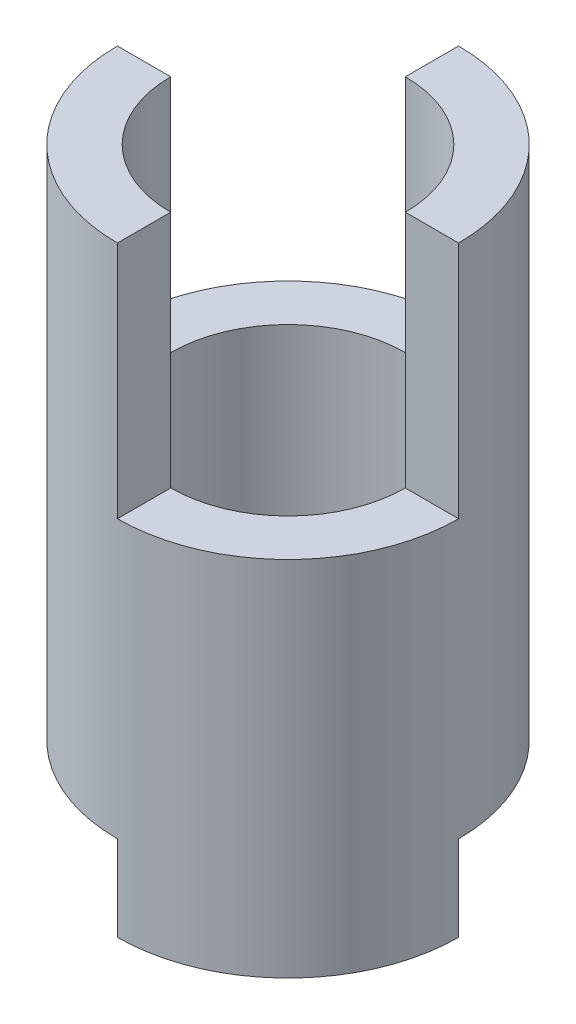
ISO-10303-21;
HEADER;
FILE_DESCRIPTION(('STEP AP214'),'2;1');
FILE_NAME('part.step','',(''),(''),'','','');
FILE_SCHEMA(('AUTOMOTIVE_DESIGN { 1 0 10303 214 1 1 1 1 }'));
ENDSEC;
DATA;
#1=APPLICATION_CONTEXT('core data for automotive mechanical design processes');
#2=APPLICATION_PROTOCOL_DEFINITION('international standard','automotive_design',2000,#1);
#3=PRODUCT_CONTEXT('',#1,'mechanical');
#4=PRODUCT('Part','Part','',(#3));
#5=PRODUCT_RELATED_PRODUCT_CATEGORY('part','',(#4));
#6=PRODUCT_DEFINITION_FORMATION('','',#4);
#7=PRODUCT_DEFINITION_CONTEXT('part definition',#1,'design');
#8=PRODUCT_DEFINITION('design','',#6,#7);
#9=PRODUCT_DEFINITION_SHAPE('','',#8);
#10=(LENGTH_UNIT() NAMED_UNIT(*) SI_UNIT(.MILLI.,.METRE.));
#11=(NAMED_UNIT(*) PLANE_ANGLE_UNIT() SI_UNIT($,.RADIAN.));
#12=(NAMED_UNIT(*) SI_UNIT($,.STERADIAN.) SOLID_ANGLE_UNIT());
#13=UNCERTAINTY_MEASURE_WITH_UNIT(LENGTH_MEASURE(1.E-05),#10,'distance_accuracy_value','');
#14=(GEOMETRIC_REPRESENTATION_CONTEXT(3) GLOBAL_UNCERTAINTY_ASSIGNED_CONTEXT((#13)) GLOBAL_UNIT_ASSIGNED_CONTEXT((#10,
#11,#12)) REPRESENTATION_CONTEXT('',''));
#15=CARTESIAN_POINT('',(0.,0.,0.));
#16=DIRECTION('',(0.,0.,1.));
#17=DIRECTION('',(1.,0.,0.));
#18=AXIS2_PLACEMENT_3D('',#15,#16,#17);
#19=CARTESIAN_POINT('',(0.,0.,0.));
#20=DIRECTION('',(0.,1.,0.));
#21=DIRECTION('',(0.,0.,1.));
#22=AXIS2_PLACEMENT_3D('',#19,#20,#21);
#23=PLANE('',#22);
#24=CARTESIAN_POINT('',(0.,0.,0.));
#25=DIRECTION('',(0.,1.,0.));
#26=DIRECTION('',(0.,0.,1.));
#27=AXIS2_PLACEMENT_3D('',#24,#25,#26);
#28=CIRCLE('',#27,2.75);
#29=CARTESIAN_POINT('',(0.,0.,2.75));
#30=VERTEX_POINT('',#29);
#31=CARTESIAN_POINT('',(2.75,0.,0.));
#32=VERTEX_POINT('',#31);
#33=EDGE_CURVE('E260',#30,#32,#28,.T.);
#34=ORIENTED_EDGE('',*,*,#33,.T.);
#35=DIRECTION('',(-1.,0.,0.));
#36=VECTOR('',#35,1.);
#37=CARTESIAN_POINT('',(2.75,0.,0.));
#38=LINE('',#37,#36);
#39=CARTESIAN_POINT('',(4.,0.,0.));
#40=VERTEX_POINT('',#39);
#41=EDGE_CURVE('E172',#40,#32,#38,.T.);
#42=ORIENTED_EDGE('',*,*,#41,.F.);
#43=CARTESIAN_POINT('',(0.,0.,0.));
#44=DIRECTION('',(0.,1.,0.));
#45=DIRECTION('',(0.,0.,1.));
#46=AXIS2_PLACEMENT_3D('',#43,#44,#45);
#47=CIRCLE('',#46,4.);
#48=CARTESIAN_POINT('',(0.,0.,4.));
#49=VERTEX_POINT('',#48);
#50=EDGE_CURVE('E46',#49,#40,#47,.T.);
#51=ORIENTED_EDGE('',*,*,#50,.F.);
#52=DIRECTION('',(0.,0.,1.));
#53=VECTOR('',#52,1.);
#54=CARTESIAN_POINT('',(0.,0.,2.75));
#55=LINE('',#54,#53);
#56=EDGE_CURVE('E196',#30,#49,#55,.T.);
#57=ORIENTED_EDGE('',*,*,#56,.F.);
#58=EDGE_LOOP('',(#34,#42,#51,#57));
#59=FACE_BOUND('',#58,.T.);
#60=ADVANCED_FACE('F42',(#59),#23,.F.);
#61=CARTESIAN_POINT('',(0.,14.1,0.));
#62=DIRECTION('',(0.,1.,0.));
#63=DIRECTION('',(0.,0.,1.));
#64=AXIS2_PLACEMENT_3D('',#61,#62,#63);
#65=PLANE('',#64);
#66=DIRECTION('',(-1.,0.,0.));
#67=VECTOR('',#66,1.);
#68=CARTESIAN_POINT('',(2.75,14.1,0.));
#69=LINE('',#68,#67);
#70=CARTESIAN_POINT('',(4.,14.1,0.));
#71=VERTEX_POINT('',#70);
#72=CARTESIAN_POINT('',(2.75,14.1,0.));
#73=VERTEX_POINT('',#72);
#74=EDGE_CURVE('E213',#71,#73,#69,.T.);
#75=ORIENTED_EDGE('',*,*,#74,.F.);
#76=CARTESIAN_POINT('',(0.,14.1,0.));
#77=DIRECTION('',(0.,1.,0.));
#78=DIRECTION('',(0.,0.,1.));
#79=AXIS2_PLACEMENT_3D('',#76,#77,#78);
#80=CIRCLE('',#79,4.);
#81=CARTESIAN_POINT('',(0.,14.1,-4.));
#82=VERTEX_POINT('',#81);
#83=EDGE_CURVE('E12',#71,#82,#80,.T.);
#84=ORIENTED_EDGE('',*,*,#83,.T.);
#85=DIRECTION('',(0.,0.,-1.));
#86=VECTOR('',#85,1.);
#87=CARTESIAN_POINT('',(0.,14.1,-2.75));
#88=LINE('',#87,#86);
#89=CARTESIAN_POINT('',(0.,14.1,-2.75));
#90=VERTEX_POINT('',#89);
#91=EDGE_CURVE('E226',#90,#82,#88,.T.);
#92=ORIENTED_EDGE('',*,*,#91,.F.);
#93=CARTESIAN_POINT('',(0.,14.1,0.));
#94=DIRECTION('',(0.,1.,0.));
#95=DIRECTION('',(0.,0.,1.));
#96=AXIS2_PLACEMENT_3D('',#93,#94,#95);
#97=CIRCLE('',#96,2.75);
#98=EDGE_CURVE('E259',#73,#90,#97,.T.);
#99=ORIENTED_EDGE('',*,*,#98,.F.);
#100=EDGE_LOOP('',(#75,#84,#92,#99));
#101=FACE_BOUND('',#100,.T.);
#102=ADVANCED_FACE('F284',(#101),#65,.T.);
#103=DIRECTION('',(0.,0.,1.));
#104=VECTOR('',#103,1.);
#105=CARTESIAN_POINT('',(0.,14.1,2.75));
#106=LINE('',#105,#104);
#107=CARTESIAN_POINT('',(0.,14.1,2.75));
#108=VERTEX_POINT('',#107);
#109=CARTESIAN_POINT('',(0.,14.1,4.));
#110=VERTEX_POINT('',#109);
#111=EDGE_CURVE('E202',#108,#110,#106,.T.);
#112=ORIENTED_EDGE('',*,*,#111,.F.);
#113=CARTESIAN_POINT('',(-2.75,14.1,0.));
#114=VERTEX_POINT('',#113);
#115=EDGE_CURVE('E256',#114,#108,#97,.T.);
#116=ORIENTED_EDGE('',*,*,#115,.F.);
#117=DIRECTION('',(1.,0.,0.));
#118=VECTOR('',#117,1.);
#119=CARTESIAN_POINT('',(-2.75,14.1,0.));
#120=LINE('',#119,#118);
#121=CARTESIAN_POINT('',(-4.,14.1,0.));
#122=VERTEX_POINT('',#121);
#123=EDGE_CURVE('E237',#122,#114,#120,.T.);
#124=ORIENTED_EDGE('',*,*,#123,.F.);
#125=EDGE_CURVE('E51',#122,#110,#80,.T.);
#126=ORIENTED_EDGE('',*,*,#125,.T.);
#127=EDGE_LOOP('',(#112,#116,#124,#126));
#128=FACE_BOUND('',#127,.T.);
#129=ADVANCED_FACE('F300',(#128),#65,.T.);
#130=CARTESIAN_POINT('',(0.,0.,-4.));
#131=VERTEX_POINT('',#130);
#132=CARTESIAN_POINT('',(-4.,0.,0.));
#133=VERTEX_POINT('',#132);
#134=EDGE_CURVE('E268',#131,#133,#47,.T.);
#135=ORIENTED_EDGE('',*,*,#134,.F.);
#136=DIRECTION('',(0.,0.,-1.));
#137=VECTOR('',#136,1.);
#138=CARTESIAN_POINT('',(0.,0.,-2.75));
#139=LINE('',#138,#137);
#140=CARTESIAN_POINT('',(0.,0.,-2.75));
#141=VERTEX_POINT('',#140);
#142=EDGE_CURVE('E332',#141,#131,#139,.T.);
#143=ORIENTED_EDGE('',*,*,#142,.F.);
#144=CARTESIAN_POINT('',(-2.75,0.,0.));
#145=VERTEX_POINT('',#144);
#146=EDGE_CURVE('E179',#141,#145,#28,.T.);
#147=ORIENTED_EDGE('',*,*,#146,.T.);
#148=DIRECTION('',(1.,0.,0.));
#149=VECTOR('',#148,1.);
#150=CARTESIAN_POINT('',(-2.75,0.,0.));
#151=LINE('',#150,#149);
#152=EDGE_CURVE('E189',#133,#145,#151,.T.);
#153=ORIENTED_EDGE('',*,*,#152,.F.);
#154=EDGE_LOOP('',(#135,#143,#147,#153));
#155=FACE_BOUND('',#154,.T.);
#156=ADVANCED_FACE('F320',(#155),#23,.F.);
#157=CARTESIAN_POINT('',(0.,14.1,0.));
#158=DIRECTION('',(0.,-1.,0.));
#159=DIRECTION('',(0.,0.,-1.));
#160=AXIS2_PLACEMENT_3D('',#157,#158,#159);
#161=CYLINDRICAL_SURFACE('',#160,4.);
#162=ORIENTED_EDGE('',*,*,#50,.T.);
#163=DIRECTION('',(0.,-1.,0.));
#164=VECTOR('',#163,1.);
#165=CARTESIAN_POINT('',(4.,2.,0.));
#166=LINE('',#165,#164);
#167=CARTESIAN_POINT('',(4.,2.,0.));
#168=VERTEX_POINT('',#167);
#169=EDGE_CURVE('E181',#168,#40,#166,.T.);
#170=ORIENTED_EDGE('',*,*,#169,.F.);
#171=CARTESIAN_POINT('',(0.,2.,0.));
#172=DIRECTION('',(0.,-1.,0.));
#173=DIRECTION('',(0.,0.,-1.));
#174=AXIS2_PLACEMENT_3D('',#171,#172,#173);
#175=CIRCLE('',#174,4.);
#176=CARTESIAN_POINT('',(0.,2.,-4.));
#177=VERTEX_POINT('',#176);
#178=EDGE_CURVE('E165',#177,#168,#175,.T.);
#179=ORIENTED_EDGE('',*,*,#178,.F.);
#180=DIRECTION('',(0.,-1.,0.));
#181=VECTOR('',#180,1.);
#182=CARTESIAN_POINT('',(0.,2.,-4.));
#183=LINE('',#182,#181);
#184=EDGE_CURVE('E163',#177,#131,#183,.T.);
#185=ORIENTED_EDGE('',*,*,#184,.T.);
#186=ORIENTED_EDGE('',*,*,#134,.T.);
#187=DIRECTION('',(0.,-1.,0.));
#188=VECTOR('',#187,1.);
#189=CARTESIAN_POINT('',(-4.,2.,0.));
#190=LINE('',#189,#188);
#191=CARTESIAN_POINT('',(-4.,2.,0.));
#192=VERTEX_POINT('',#191);
#193=EDGE_CURVE('E203',#192,#133,#190,.T.);
#194=ORIENTED_EDGE('',*,*,#193,.F.);
#195=CARTESIAN_POINT('',(0.,2.,0.));
#196=DIRECTION('',(0.,-1.,0.));
#197=DIRECTION('',(0.,0.,-1.));
#198=AXIS2_PLACEMENT_3D('',#195,#196,#197);
#199=CIRCLE('',#198,4.);
#200=CARTESIAN_POINT('',(0.,2.,4.));
#201=VERTEX_POINT('',#200);
#202=EDGE_CURVE('E192',#201,#192,#199,.T.);
#203=ORIENTED_EDGE('',*,*,#202,.F.);
#204=DIRECTION('',(0.,-1.,0.));
#205=VECTOR('',#204,1.);
#206=CARTESIAN_POINT('',(0.,2.,4.));
#207=LINE('',#206,#205);
#208=EDGE_CURVE('E205',#201,#49,#207,.T.);
#209=ORIENTED_EDGE('',*,*,#208,.T.);
#210=EDGE_LOOP('',(#162,#170,#179,#185,#186,#194,#203,#209));
#211=FACE_BOUND('',#210,.T.);
#212=ORIENTED_EDGE('',*,*,#83,.F.);
#213=DIRECTION('',(0.,1.,0.));
#214=VECTOR('',#213,1.);
#215=CARTESIAN_POINT('',(4.,8.5,0.));
#216=LINE('',#215,#214);
#217=CARTESIAN_POINT('',(4.,8.5,0.));
#218=VERTEX_POINT('',#217);
#219=EDGE_CURVE('E227',#218,#71,#216,.T.);
#220=ORIENTED_EDGE('',*,*,#219,.F.);
#221=CARTESIAN_POINT('',(0.,8.5,0.));
#222=DIRECTION('',(0.,1.,0.));
#223=DIRECTION('',(0.,0.,1.));
#224=AXIS2_PLACEMENT_3D('',#221,#222,#223);
#225=CIRCLE('',#224,4.);
#226=CARTESIAN_POINT('',(0.,8.5,4.));
#227=VERTEX_POINT('',#226);
#228=EDGE_CURVE('E216',#227,#218,#225,.T.);
#229=ORIENTED_EDGE('',*,*,#228,.F.);
#230=DIRECTION('',(0.,1.,0.));
#231=VECTOR('',#230,1.);
#232=CARTESIAN_POINT('',(0.,8.5,4.));
#233=LINE('',#232,#231);
#234=EDGE_CURVE('E229',#227,#110,#233,.T.);
#235=ORIENTED_EDGE('',*,*,#234,.T.);
#236=ORIENTED_EDGE('',*,*,#125,.F.);
#237=DIRECTION('',(0.,1.,0.));
#238=VECTOR('',#237,1.);
#239=CARTESIAN_POINT('',(-4.,8.5,0.));
#240=LINE('',#239,#238);
#241=CARTESIAN_POINT('',(-4.,8.5,0.));
#242=VERTEX_POINT('',#241);
#243=EDGE_CURVE('E250',#242,#122,#240,.T.);
#244=ORIENTED_EDGE('',*,*,#243,.F.);
#245=CARTESIAN_POINT('',(0.,8.5,0.));
#246=DIRECTION('',(0.,1.,0.));
#247=DIRECTION('',(0.,0.,1.));
#248=AXIS2_PLACEMENT_3D('',#245,#246,#247);
#249=CIRCLE('',#248,4.);
#250=CARTESIAN_POINT('',(0.,8.5,-4.));
#251=VERTEX_POINT('',#250);
#252=EDGE_CURVE('E240',#251,#242,#249,.T.);
#253=ORIENTED_EDGE('',*,*,#252,.F.);
#254=DIRECTION('',(0.,1.,0.));
#255=VECTOR('',#254,1.);
#256=CARTESIAN_POINT('',(0.,8.5,-4.));
#257=LINE('',#256,#255);
#258=EDGE_CURVE('E252',#251,#82,#257,.T.);
#259=ORIENTED_EDGE('',*,*,#258,.T.);
#260=EDGE_LOOP('',(#212,#220,#229,#235,#236,#244,#253,#259));
#261=FACE_BOUND('',#260,.T.);
#262=ADVANCED_FACE('F44',(#211,#261),#161,.T.);
#263=CARTESIAN_POINT('',(0.,14.1,0.));
#264=DIRECTION('',(0.,-1.,0.));
#265=DIRECTION('',(0.,0.,-1.));
#266=AXIS2_PLACEMENT_3D('',#263,#264,#265);
#267=CYLINDRICAL_SURFACE('',#266,2.75);
#268=DIRECTION('',(0.,-1.,0.));
#269=VECTOR('',#268,1.);
#270=CARTESIAN_POINT('',(2.75,2.,0.));
#271=LINE('',#270,#269);
#272=CARTESIAN_POINT('',(2.75,2.,0.));
#273=VERTEX_POINT('',#272);
#274=EDGE_CURVE('E198',#273,#32,#271,.T.);
#275=ORIENTED_EDGE('',*,*,#274,.T.);
#276=ORIENTED_EDGE('',*,*,#33,.F.);
#277=DIRECTION('',(0.,-1.,0.));
#278=VECTOR('',#277,1.);
#279=CARTESIAN_POINT('',(0.,2.,2.75));
#280=LINE('',#279,#278);
#281=CARTESIAN_POINT('',(0.,2.,2.75));
#282=VERTEX_POINT('',#281);
#283=EDGE_CURVE('E195',#282,#30,#280,.T.);
#284=ORIENTED_EDGE('',*,*,#283,.F.);
#285=CARTESIAN_POINT('',(0.,2.,0.));
#286=DIRECTION('',(0.,1.,0.));
#287=DIRECTION('',(0.,0.,-1.));
#288=AXIS2_PLACEMENT_3D('',#285,#286,#287);
#289=CIRCLE('',#288,2.75);
#290=CARTESIAN_POINT('',(-2.75,2.,0.));
#291=VERTEX_POINT('',#290);
#292=EDGE_CURVE('E186',#291,#282,#289,.T.);
#293=ORIENTED_EDGE('',*,*,#292,.F.);
#294=DIRECTION('',(0.,-1.,0.));
#295=VECTOR('',#294,1.);
#296=CARTESIAN_POINT('',(-2.75,2.,0.));
#297=LINE('',#296,#295);
#298=EDGE_CURVE('E200',#291,#145,#297,.T.);
#299=ORIENTED_EDGE('',*,*,#298,.T.);
#300=ORIENTED_EDGE('',*,*,#146,.F.);
#301=DIRECTION('',(0.,-1.,0.));
#302=VECTOR('',#301,1.);
#303=CARTESIAN_POINT('',(0.,2.,-2.75));
#304=LINE('',#303,#302);
#305=CARTESIAN_POINT('',(0.,2.,-2.75));
#306=VERTEX_POINT('',#305);
#307=EDGE_CURVE('E160',#306,#141,#304,.T.);
#308=ORIENTED_EDGE('',*,*,#307,.F.);
#309=CARTESIAN_POINT('',(0.,2.,0.));
#310=DIRECTION('',(0.,1.,0.));
#311=DIRECTION('',(0.,0.,-1.));
#312=AXIS2_PLACEMENT_3D('',#309,#310,#311);
#313=CIRCLE('',#312,2.75);
#314=EDGE_CURVE('E166',#273,#306,#313,.T.);
#315=ORIENTED_EDGE('',*,*,#314,.F.);
#316=EDGE_LOOP('',(#275,#276,#284,#293,#299,#300,#308,#315));
#317=FACE_BOUND('',#316,.T.);
#318=DIRECTION('',(0.,1.,0.));
#319=VECTOR('',#318,1.);
#320=CARTESIAN_POINT('',(2.75,8.5,0.));
#321=LINE('',#320,#319);
#322=CARTESIAN_POINT('',(2.75,8.5,0.));
#323=VERTEX_POINT('',#322);
#324=EDGE_CURVE('E223',#323,#73,#321,.T.);
#325=ORIENTED_EDGE('',*,*,#324,.T.);
#326=ORIENTED_EDGE('',*,*,#98,.T.);
#327=DIRECTION('',(0.,1.,0.));
#328=VECTOR('',#327,1.);
#329=CARTESIAN_POINT('',(0.,8.5,-2.75));
#330=LINE('',#329,#328);
#331=CARTESIAN_POINT('',(0.,8.5,-2.75));
#332=VERTEX_POINT('',#331);
#333=EDGE_CURVE('E244',#332,#90,#330,.T.);
#334=ORIENTED_EDGE('',*,*,#333,.F.);
#335=CARTESIAN_POINT('',(0.,8.5,0.));
#336=DIRECTION('',(0.,-1.,0.));
#337=DIRECTION('',(0.,0.,1.));
#338=AXIS2_PLACEMENT_3D('',#335,#336,#337);
#339=CIRCLE('',#338,2.75);
#340=CARTESIAN_POINT('',(-2.75,8.5,0.));
#341=VERTEX_POINT('',#340);
#342=EDGE_CURVE('E233',#341,#332,#339,.T.);
#343=ORIENTED_EDGE('',*,*,#342,.F.);
#344=DIRECTION('',(0.,1.,0.));
#345=VECTOR('',#344,1.);
#346=CARTESIAN_POINT('',(-2.75,8.5,0.));
#347=LINE('',#346,#345);
#348=EDGE_CURVE('E247',#341,#114,#347,.T.);
#349=ORIENTED_EDGE('',*,*,#348,.T.);
#350=ORIENTED_EDGE('',*,*,#115,.T.);
#351=DIRECTION('',(0.,1.,0.));
#352=VECTOR('',#351,1.);
#353=CARTESIAN_POINT('',(0.,8.5,2.75));
#354=LINE('',#353,#352);
#355=CARTESIAN_POINT('',(0.,8.5,2.75));
#356=VERTEX_POINT('',#355);
#357=EDGE_CURVE('E220',#356,#108,#354,.T.);
#358=ORIENTED_EDGE('',*,*,#357,.F.);
#359=CARTESIAN_POINT('',(0.,8.5,0.));
#360=DIRECTION('',(0.,-1.,0.));
#361=DIRECTION('',(0.,0.,1.));
#362=AXIS2_PLACEMENT_3D('',#359,#360,#361);
#363=CIRCLE('',#362,2.75);
#364=EDGE_CURVE('E209',#323,#356,#363,.T.);
#365=ORIENTED_EDGE('',*,*,#364,.F.);
#366=EDGE_LOOP('',(#325,#326,#334,#343,#349,#350,#358,#365));
#367=FACE_BOUND('',#366,.T.);
#368=ADVANCED_FACE('F175',(#317,#367),#267,.F.);
#369=CARTESIAN_POINT('',(-2.75,8.5,0.));
#370=DIRECTION('',(0.,0.,1.));
#371=DIRECTION('',(1.,0.,0.));
#372=AXIS2_PLACEMENT_3D('',#369,#370,#371);
#373=PLANE('',#372);
#374=ORIENTED_EDGE('',*,*,#123,.T.);
#375=ORIENTED_EDGE('',*,*,#348,.F.);
#376=DIRECTION('',(1.,0.,0.));
#377=VECTOR('',#376,1.);
#378=CARTESIAN_POINT('',(-2.75,8.5,0.));
#379=LINE('',#378,#377);
#380=EDGE_CURVE('E242',#242,#341,#379,.T.);
#381=ORIENTED_EDGE('',*,*,#380,.F.);
#382=ORIENTED_EDGE('',*,*,#243,.T.);
#383=EDGE_LOOP('',(#374,#375,#381,#382));
#384=FACE_BOUND('',#383,.T.);
#385=ADVANCED_FACE('F297',(#384),#373,.F.);
#386=CARTESIAN_POINT('',(0.,8.5,-2.75));
#387=DIRECTION('',(1.,0.,0.));
#388=DIRECTION('',(0.,0.,-1.));
#389=AXIS2_PLACEMENT_3D('',#386,#387,#388);
#390=PLANE('',#389);
#391=ORIENTED_EDGE('',*,*,#91,.T.);
#392=ORIENTED_EDGE('',*,*,#258,.F.);
#393=DIRECTION('',(0.,0.,-1.));
#394=VECTOR('',#393,1.);
#395=CARTESIAN_POINT('',(0.,8.5,-2.75));
#396=LINE('',#395,#394);
#397=EDGE_CURVE('E236',#332,#251,#396,.T.);
#398=ORIENTED_EDGE('',*,*,#397,.F.);
#399=ORIENTED_EDGE('',*,*,#333,.T.);
#400=EDGE_LOOP('',(#391,#392,#398,#399));
#401=FACE_BOUND('',#400,.T.);
#402=ADVANCED_FACE('F287',(#401),#390,.F.);
#403=CARTESIAN_POINT('',(0.,8.5,0.));
#404=DIRECTION('',(0.,1.,0.));
#405=DIRECTION('',(0.,0.,1.));
#406=AXIS2_PLACEMENT_3D('',#403,#404,#405);
#407=PLANE('',#406);
#408=ORIENTED_EDGE('',*,*,#342,.T.);
#409=ORIENTED_EDGE('',*,*,#397,.T.);
#410=ORIENTED_EDGE('',*,*,#252,.T.);
#411=ORIENTED_EDGE('',*,*,#380,.T.);
#412=EDGE_LOOP('',(#408,#409,#410,#411));
#413=FACE_BOUND('',#412,.T.);
#414=ADVANCED_FACE('F294',(#413),#407,.T.);
#415=CARTESIAN_POINT('',(2.75,8.5,0.));
#416=DIRECTION('',(0.,0.,-1.));
#417=DIRECTION('',(-1.,0.,0.));
#418=AXIS2_PLACEMENT_3D('',#415,#416,#417);
#419=PLANE('',#418);
#420=ORIENTED_EDGE('',*,*,#74,.T.);
#421=ORIENTED_EDGE('',*,*,#324,.F.);
#422=DIRECTION('',(-1.,0.,0.));
#423=VECTOR('',#422,1.);
#424=CARTESIAN_POINT('',(2.75,8.5,0.));
#425=LINE('',#424,#423);
#426=EDGE_CURVE('E218',#218,#323,#425,.T.);
#427=ORIENTED_EDGE('',*,*,#426,.F.);
#428=ORIENTED_EDGE('',*,*,#219,.T.);
#429=EDGE_LOOP('',(#420,#421,#427,#428));
#430=FACE_BOUND('',#429,.T.);
#431=ADVANCED_FACE('F308',(#430),#419,.F.);
#432=CARTESIAN_POINT('',(0.,8.5,2.75));
#433=DIRECTION('',(-1.,0.,0.));
#434=DIRECTION('',(0.,0.,1.));
#435=AXIS2_PLACEMENT_3D('',#432,#433,#434);
#436=PLANE('',#435);
#437=ORIENTED_EDGE('',*,*,#111,.T.);
#438=ORIENTED_EDGE('',*,*,#234,.F.);
#439=DIRECTION('',(0.,0.,1.));
#440=VECTOR('',#439,1.);
#441=CARTESIAN_POINT('',(0.,8.5,2.75));
#442=LINE('',#441,#440);
#443=EDGE_CURVE('E212',#356,#227,#442,.T.);
#444=ORIENTED_EDGE('',*,*,#443,.F.);
#445=ORIENTED_EDGE('',*,*,#357,.T.);
#446=EDGE_LOOP('',(#437,#438,#444,#445));
#447=FACE_BOUND('',#446,.T.);
#448=ADVANCED_FACE('F302',(#447),#436,.F.);
#449=CARTESIAN_POINT('',(0.,8.5,0.));
#450=DIRECTION('',(0.,1.,0.));
#451=DIRECTION('',(0.,0.,1.));
#452=AXIS2_PLACEMENT_3D('',#449,#450,#451);
#453=PLANE('',#452);
#454=ORIENTED_EDGE('',*,*,#364,.T.);
#455=ORIENTED_EDGE('',*,*,#443,.T.);
#456=ORIENTED_EDGE('',*,*,#228,.T.);
#457=ORIENTED_EDGE('',*,*,#426,.T.);
#458=EDGE_LOOP('',(#454,#455,#456,#457));
#459=FACE_BOUND('',#458,.T.);
#460=ADVANCED_FACE('F306',(#459),#453,.T.);
#461=CARTESIAN_POINT('',(-2.75,2.,0.));
#462=DIRECTION('',(0.,0.,-1.));
#463=DIRECTION('',(-1.,0.,0.));
#464=AXIS2_PLACEMENT_3D('',#461,#462,#463);
#465=PLANE('',#464);
#466=ORIENTED_EDGE('',*,*,#152,.T.);
#467=ORIENTED_EDGE('',*,*,#298,.F.);
#468=DIRECTION('',(1.,0.,0.));
#469=VECTOR('',#468,1.);
#470=CARTESIAN_POINT('',(-2.75,2.,0.));
#471=LINE('',#470,#469);
#472=EDGE_CURVE('E66',#192,#291,#471,.T.);
#473=ORIENTED_EDGE('',*,*,#472,.F.);
#474=ORIENTED_EDGE('',*,*,#193,.T.);
#475=EDGE_LOOP('',(#466,#467,#473,#474));
#476=FACE_BOUND('',#475,.T.);
#477=ADVANCED_FACE('F334',(#476),#465,.F.);
#478=CARTESIAN_POINT('',(0.,2.,2.75));
#479=DIRECTION('',(1.,0.,0.));
#480=DIRECTION('',(0.,0.,-1.));
#481=AXIS2_PLACEMENT_3D('',#478,#479,#480);
#482=PLANE('',#481);
#483=ORIENTED_EDGE('',*,*,#56,.T.);
#484=ORIENTED_EDGE('',*,*,#208,.F.);
#485=DIRECTION('',(0.,0.,1.));
#486=VECTOR('',#485,1.);
#487=CARTESIAN_POINT('',(0.,2.,2.75));
#488=LINE('',#487,#486);
#489=EDGE_CURVE('E188',#282,#201,#488,.T.);
#490=ORIENTED_EDGE('',*,*,#489,.F.);
#491=ORIENTED_EDGE('',*,*,#283,.T.);
#492=EDGE_LOOP('',(#483,#484,#490,#491));
#493=FACE_BOUND('',#492,.T.);
#494=ADVANCED_FACE('F356',(#493),#482,.F.);
#495=CARTESIAN_POINT('',(0.,2.,0.));
#496=DIRECTION('',(0.,-1.,0.));
#497=DIRECTION('',(0.,0.,-1.));
#498=AXIS2_PLACEMENT_3D('',#495,#496,#497);
#499=PLANE('',#498);
#500=ORIENTED_EDGE('',*,*,#292,.T.);
#501=ORIENTED_EDGE('',*,*,#489,.T.);
#502=ORIENTED_EDGE('',*,*,#202,.T.);
#503=ORIENTED_EDGE('',*,*,#472,.T.);
#504=EDGE_LOOP('',(#500,#501,#502,#503));
#505=FACE_BOUND('',#504,.T.);
#506=ADVANCED_FACE('F338',(#505),#499,.T.);
#507=CARTESIAN_POINT('',(2.75,2.,0.));
#508=DIRECTION('',(0.,0.,1.));
#509=DIRECTION('',(1.,0.,0.));
#510=AXIS2_PLACEMENT_3D('',#507,#508,#509);
#511=PLANE('',#510);
#512=ORIENTED_EDGE('',*,*,#41,.T.);
#513=ORIENTED_EDGE('',*,*,#274,.F.);
#514=DIRECTION('',(-1.,0.,0.));
#515=VECTOR('',#514,1.);
#516=CARTESIAN_POINT('',(2.75,2.,0.));
#517=LINE('',#516,#515);
#518=EDGE_CURVE('E58',#168,#273,#517,.T.);
#519=ORIENTED_EDGE('',*,*,#518,.F.);
#520=ORIENTED_EDGE('',*,*,#169,.T.);
#521=EDGE_LOOP('',(#512,#513,#519,#520));
#522=FACE_BOUND('',#521,.T.);
#523=ADVANCED_FACE('F347',(#522),#511,.F.);
#524=CARTESIAN_POINT('',(0.,2.,-2.75));
#525=DIRECTION('',(-1.,0.,0.));
#526=DIRECTION('',(0.,0.,1.));
#527=AXIS2_PLACEMENT_3D('',#524,#525,#526);
#528=PLANE('',#527);
#529=ORIENTED_EDGE('',*,*,#142,.T.);
#530=ORIENTED_EDGE('',*,*,#184,.F.);
#531=DIRECTION('',(0.,0.,-1.));
#532=VECTOR('',#531,1.);
#533=CARTESIAN_POINT('',(0.,2.,-2.75));
#534=LINE('',#533,#532);
#535=EDGE_CURVE('E157',#306,#177,#534,.T.);
#536=ORIENTED_EDGE('',*,*,#535,.F.);
#537=ORIENTED_EDGE('',*,*,#307,.T.);
#538=EDGE_LOOP('',(#529,#530,#536,#537));
#539=FACE_BOUND('',#538,.T.);
#540=ADVANCED_FACE('F158',(#539),#528,.F.);
#541=CARTESIAN_POINT('',(0.,2.,0.));
#542=DIRECTION('',(0.,-1.,0.));
#543=DIRECTION('',(0.,0.,-1.));
#544=AXIS2_PLACEMENT_3D('',#541,#542,#543);
#545=PLANE('',#544);
#546=ORIENTED_EDGE('',*,*,#314,.T.);
#547=ORIENTED_EDGE('',*,*,#535,.T.);
#548=ORIENTED_EDGE('',*,*,#178,.T.);
#549=ORIENTED_EDGE('',*,*,#518,.T.);
#550=EDGE_LOOP('',(#546,#547,#548,#549));
#551=FACE_BOUND('',#550,.T.);
#552=ADVANCED_FACE('F169',(#551),#545,.T.);
#553=CLOSED_SHELL('',(#60,#102,#129,#156,#262,#368,#385,#402,#414,#431,#448,#460,#477,#494,#506,
#523,#540,#552));
#554=MANIFOLD_SOLID_BREP('B2',#553);
#555=ADVANCED_BREP_SHAPE_REPRESENTATION('',(#18,#554),#14);
#556=SHAPE_DEFINITION_REPRESENTATION(#9,#555);
ENDSEC;
END-ISO-10303-21;
